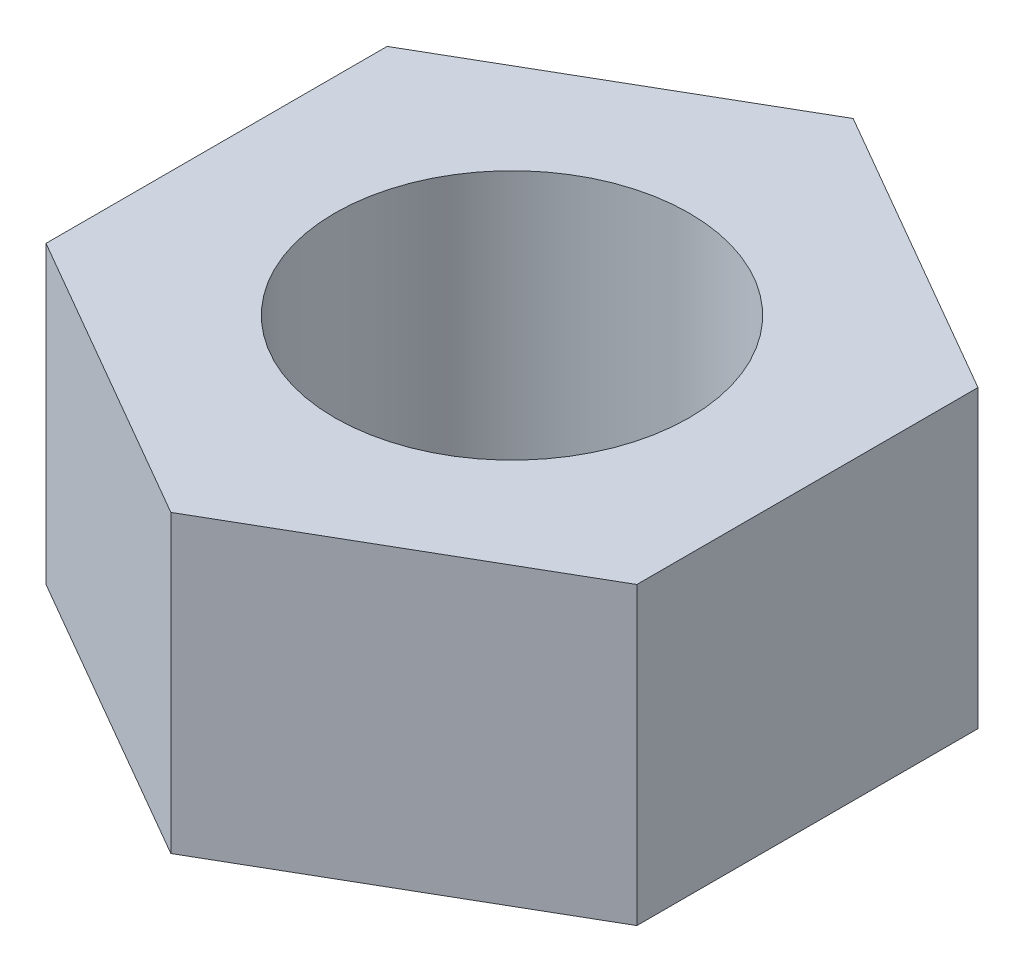
ISO-10303-21;
HEADER;
FILE_DESCRIPTION(('STEP AP214'),'2;1');
FILE_NAME('part.step','',(''),(''),'','','');
FILE_SCHEMA(('AUTOMOTIVE_DESIGN { 1 0 10303 214 1 1 1 1 }'));
ENDSEC;
DATA;
#1=APPLICATION_CONTEXT('core data for automotive mechanical design processes');
#2=APPLICATION_PROTOCOL_DEFINITION('international standard','automotive_design',2000,#1);
#3=PRODUCT_CONTEXT('',#1,'mechanical');
#4=PRODUCT('Part','Part','',(#3));
#5=PRODUCT_RELATED_PRODUCT_CATEGORY('part','',(#4));
#6=PRODUCT_DEFINITION_FORMATION('','',#4);
#7=PRODUCT_DEFINITION_CONTEXT('part definition',#1,'design');
#8=PRODUCT_DEFINITION('design','',#6,#7);
#9=PRODUCT_DEFINITION_SHAPE('','',#8);
#10=(LENGTH_UNIT() NAMED_UNIT(*) SI_UNIT(.MILLI.,.METRE.));
#11=(NAMED_UNIT(*) PLANE_ANGLE_UNIT() SI_UNIT($,.RADIAN.));
#12=(NAMED_UNIT(*) SI_UNIT($,.STERADIAN.) SOLID_ANGLE_UNIT());
#13=UNCERTAINTY_MEASURE_WITH_UNIT(LENGTH_MEASURE(1.E-05),#10,'distance_accuracy_value','');
#14=(GEOMETRIC_REPRESENTATION_CONTEXT(3) GLOBAL_UNCERTAINTY_ASSIGNED_CONTEXT((#13)) GLOBAL_UNIT_ASSIGNED_CONTEXT((#10,
#11,#12)) REPRESENTATION_CONTEXT('',''));
#15=CARTESIAN_POINT('',(0.,0.,0.));
#16=DIRECTION('',(0.,0.,1.));
#17=DIRECTION('',(1.,0.,0.));
#18=AXIS2_PLACEMENT_3D('',#15,#16,#17);
#19=CARTESIAN_POINT('',(0.,2.5,0.));
#20=DIRECTION('',(0.,1.,0.));
#21=DIRECTION('',(0.,0.,1.));
#22=AXIS2_PLACEMENT_3D('',#19,#20,#21);
#23=PLANE('',#22);
#24=DIRECTION('',(-0.866025403784439,0.,-0.5));
#25=VECTOR('',#24,1.);
#26=CARTESIAN_POINT('',(2.5,2.5,-1.44337567297406));
#27=LINE('',#26,#25);
#28=CARTESIAN_POINT('',(2.5,2.5,-1.44337567297406));
#29=VERTEX_POINT('',#28);
#30=CARTESIAN_POINT('',(0.,2.5,-2.88675134594813));
#31=VERTEX_POINT('',#30);
#32=EDGE_CURVE('E129',#29,#31,#27,.T.);
#33=ORIENTED_EDGE('',*,*,#32,.T.);
#34=DIRECTION('',(-0.866025403784439,0.,0.5));
#35=VECTOR('',#34,1.);
#36=CARTESIAN_POINT('',(0.,2.5,-2.88675134594813));
#37=LINE('',#36,#35);
#38=CARTESIAN_POINT('',(-2.5,2.5,-1.44337567297406));
#39=VERTEX_POINT('',#38);
#40=EDGE_CURVE('E87',#31,#39,#37,.T.);
#41=ORIENTED_EDGE('',*,*,#40,.T.);
#42=DIRECTION('',(0.,0.,1.));
#43=VECTOR('',#42,1.);
#44=CARTESIAN_POINT('',(-2.5,2.5,-1.44337567297406));
#45=LINE('',#44,#43);
#46=CARTESIAN_POINT('',(-2.5,2.5,1.44337567297406));
#47=VERTEX_POINT('',#46);
#48=EDGE_CURVE('E100',#39,#47,#45,.T.);
#49=ORIENTED_EDGE('',*,*,#48,.T.);
#50=DIRECTION('',(0.866025403784439,0.,0.5));
#51=VECTOR('',#50,1.);
#52=CARTESIAN_POINT('',(-2.5,2.5,1.44337567297406));
#53=LINE('',#52,#51);
#54=CARTESIAN_POINT('',(0.,2.5,2.88675134594813));
#55=VERTEX_POINT('',#54);
#56=EDGE_CURVE('E94',#47,#55,#53,.T.);
#57=ORIENTED_EDGE('',*,*,#56,.T.);
#58=DIRECTION('',(0.866025403784439,0.,-0.5));
#59=VECTOR('',#58,1.);
#60=CARTESIAN_POINT('',(0.,2.5,2.88675134594813));
#61=LINE('',#60,#59);
#62=CARTESIAN_POINT('',(2.5,2.5,1.44337567297407));
#63=VERTEX_POINT('',#62);
#64=EDGE_CURVE('E98',#55,#63,#61,.T.);
#65=ORIENTED_EDGE('',*,*,#64,.T.);
#66=DIRECTION('',(0.,0.,-1.));
#67=VECTOR('',#66,1.);
#68=CARTESIAN_POINT('',(2.5,2.5,1.44337567297407));
#69=LINE('',#68,#67);
#70=EDGE_CURVE('E50',#63,#29,#69,.T.);
#71=ORIENTED_EDGE('',*,*,#70,.T.);
#72=EDGE_LOOP('',(#33,#41,#49,#57,#65,#71));
#73=FACE_BOUND('',#72,.T.);
#74=CARTESIAN_POINT('',(0.,2.5,0.));
#75=DIRECTION('',(0.,1.,0.));
#76=DIRECTION('',(0.,0.,1.));
#77=AXIS2_PLACEMENT_3D('',#74,#75,#76);
#78=CIRCLE('',#77,1.5);
#79=CARTESIAN_POINT('',(0.,2.5,1.5));
#80=VERTEX_POINT('',#79);
#81=EDGE_CURVE('E122',#80,#80,#78,.T.);
#82=ORIENTED_EDGE('',*,*,#81,.F.);
#83=EDGE_LOOP('',(#82));
#84=FACE_BOUND('',#83,.T.);
#85=ADVANCED_FACE('F33',(#73,#84),#23,.T.);
#86=CARTESIAN_POINT('',(0.,0.,0.));
#87=DIRECTION('',(0.,1.,0.));
#88=DIRECTION('',(0.,0.,1.));
#89=AXIS2_PLACEMENT_3D('',#86,#87,#88);
#90=PLANE('',#89);
#91=DIRECTION('',(-0.866025403784439,0.,-0.5));
#92=VECTOR('',#91,1.);
#93=CARTESIAN_POINT('',(2.5,0.,-1.44337567297406));
#94=LINE('',#93,#92);
#95=CARTESIAN_POINT('',(2.5,0.,-1.44337567297406));
#96=VERTEX_POINT('',#95);
#97=CARTESIAN_POINT('',(0.,0.,-2.88675134594813));
#98=VERTEX_POINT('',#97);
#99=EDGE_CURVE('E118',#96,#98,#94,.T.);
#100=ORIENTED_EDGE('',*,*,#99,.F.);
#101=DIRECTION('',(0.,0.,-1.));
#102=VECTOR('',#101,1.);
#103=CARTESIAN_POINT('',(2.5,0.,1.44337567297407));
#104=LINE('',#103,#102);
#105=CARTESIAN_POINT('',(2.5,0.,1.44337567297407));
#106=VERTEX_POINT('',#105);
#107=EDGE_CURVE('E79',#106,#96,#104,.T.);
#108=ORIENTED_EDGE('',*,*,#107,.F.);
#109=DIRECTION('',(0.866025403784439,0.,-0.5));
#110=VECTOR('',#109,1.);
#111=CARTESIAN_POINT('',(0.,0.,2.88675134594813));
#112=LINE('',#111,#110);
#113=CARTESIAN_POINT('',(0.,0.,2.88675134594813));
#114=VERTEX_POINT('',#113);
#115=EDGE_CURVE('E73',#114,#106,#112,.T.);
#116=ORIENTED_EDGE('',*,*,#115,.F.);
#117=DIRECTION('',(0.866025403784439,0.,0.5));
#118=VECTOR('',#117,1.);
#119=CARTESIAN_POINT('',(-2.5,0.,1.44337567297406));
#120=LINE('',#119,#118);
#121=CARTESIAN_POINT('',(-2.5,0.,1.44337567297406));
#122=VERTEX_POINT('',#121);
#123=EDGE_CURVE('E108',#122,#114,#120,.T.);
#124=ORIENTED_EDGE('',*,*,#123,.F.);
#125=DIRECTION('',(0.,0.,1.));
#126=VECTOR('',#125,1.);
#127=CARTESIAN_POINT('',(-2.5,0.,-1.44337567297406));
#128=LINE('',#127,#126);
#129=CARTESIAN_POINT('',(-2.5,0.,-1.44337567297406));
#130=VERTEX_POINT('',#129);
#131=EDGE_CURVE('E124',#130,#122,#128,.T.);
#132=ORIENTED_EDGE('',*,*,#131,.F.);
#133=DIRECTION('',(-0.866025403784439,0.,0.5));
#134=VECTOR('',#133,1.);
#135=CARTESIAN_POINT('',(0.,0.,-2.88675134594813));
#136=LINE('',#135,#134);
#137=EDGE_CURVE('E121',#98,#130,#136,.T.);
#138=ORIENTED_EDGE('',*,*,#137,.F.);
#139=EDGE_LOOP('',(#100,#108,#116,#124,#132,#138));
#140=FACE_BOUND('',#139,.T.);
#141=CARTESIAN_POINT('',(0.,0.,0.));
#142=DIRECTION('',(0.,1.,0.));
#143=DIRECTION('',(0.,0.,1.));
#144=AXIS2_PLACEMENT_3D('',#141,#142,#143);
#145=CIRCLE('',#144,1.5);
#146=CARTESIAN_POINT('',(0.,0.,1.5));
#147=VERTEX_POINT('',#146);
#148=EDGE_CURVE('E222',#147,#147,#145,.T.);
#149=ORIENTED_EDGE('',*,*,#148,.T.);
#150=EDGE_LOOP('',(#149));
#151=FACE_BOUND('',#150,.T.);
#152=ADVANCED_FACE('F138',(#140,#151),#90,.F.);
#153=CARTESIAN_POINT('',(2.5,2.5,-1.44337567297406));
#154=DIRECTION('',(-0.5,0.,0.866025403784439));
#155=DIRECTION('',(0.866025403784439,0.,0.5));
#156=AXIS2_PLACEMENT_3D('',#153,#154,#155);
#157=PLANE('',#156);
#158=ORIENTED_EDGE('',*,*,#99,.T.);
#159=DIRECTION('',(0.,-1.,0.));
#160=VECTOR('',#159,1.);
#161=CARTESIAN_POINT('',(0.,2.5,-2.88675134594813));
#162=LINE('',#161,#160);
#163=EDGE_CURVE('E11',#31,#98,#162,.T.);
#164=ORIENTED_EDGE('',*,*,#163,.F.);
#165=ORIENTED_EDGE('',*,*,#32,.F.);
#166=DIRECTION('',(0.,-1.,0.));
#167=VECTOR('',#166,1.);
#168=CARTESIAN_POINT('',(2.5,2.5,-1.44337567297406));
#169=LINE('',#168,#167);
#170=EDGE_CURVE('E114',#29,#96,#169,.T.);
#171=ORIENTED_EDGE('',*,*,#170,.T.);
#172=EDGE_LOOP('',(#158,#164,#165,#171));
#173=FACE_BOUND('',#172,.T.);
#174=ADVANCED_FACE('F35',(#173),#157,.F.);
#175=CARTESIAN_POINT('',(0.,2.5,-2.88675134594813));
#176=DIRECTION('',(0.5,0.,0.866025403784439));
#177=DIRECTION('',(0.866025403784439,0.,-0.5));
#178=AXIS2_PLACEMENT_3D('',#175,#176,#177);
#179=PLANE('',#178);
#180=ORIENTED_EDGE('',*,*,#137,.T.);
#181=DIRECTION('',(0.,-1.,0.));
#182=VECTOR('',#181,1.);
#183=CARTESIAN_POINT('',(-2.5,2.5,-1.44337567297406));
#184=LINE('',#183,#182);
#185=EDGE_CURVE('E42',#39,#130,#184,.T.);
#186=ORIENTED_EDGE('',*,*,#185,.F.);
#187=ORIENTED_EDGE('',*,*,#40,.F.);
#188=ORIENTED_EDGE('',*,*,#163,.T.);
#189=EDGE_LOOP('',(#180,#186,#187,#188));
#190=FACE_BOUND('',#189,.T.);
#191=ADVANCED_FACE('F163',(#190),#179,.F.);
#192=CARTESIAN_POINT('',(-2.5,2.5,-1.44337567297406));
#193=DIRECTION('',(1.,0.,0.));
#194=DIRECTION('',(0.,0.,-1.));
#195=AXIS2_PLACEMENT_3D('',#192,#193,#194);
#196=PLANE('',#195);
#197=ORIENTED_EDGE('',*,*,#131,.T.);
#198=DIRECTION('',(0.,-1.,0.));
#199=VECTOR('',#198,1.);
#200=CARTESIAN_POINT('',(-2.5,2.5,1.44337567297406));
#201=LINE('',#200,#199);
#202=EDGE_CURVE('E109',#47,#122,#201,.T.);
#203=ORIENTED_EDGE('',*,*,#202,.F.);
#204=ORIENTED_EDGE('',*,*,#48,.F.);
#205=ORIENTED_EDGE('',*,*,#185,.T.);
#206=EDGE_LOOP('',(#197,#203,#204,#205));
#207=FACE_BOUND('',#206,.T.);
#208=ADVANCED_FACE('F135',(#207),#196,.F.);
#209=CARTESIAN_POINT('',(-2.5,2.5,1.44337567297406));
#210=DIRECTION('',(0.5,0.,-0.866025403784439));
#211=DIRECTION('',(-0.866025403784439,0.,-0.5));
#212=AXIS2_PLACEMENT_3D('',#209,#210,#211);
#213=PLANE('',#212);
#214=ORIENTED_EDGE('',*,*,#123,.T.);
#215=DIRECTION('',(0.,-1.,0.));
#216=VECTOR('',#215,1.);
#217=CARTESIAN_POINT('',(0.,2.5,2.88675134594813));
#218=LINE('',#217,#216);
#219=EDGE_CURVE('E105',#55,#114,#218,.T.);
#220=ORIENTED_EDGE('',*,*,#219,.F.);
#221=ORIENTED_EDGE('',*,*,#56,.F.);
#222=ORIENTED_EDGE('',*,*,#202,.T.);
#223=EDGE_LOOP('',(#214,#220,#221,#222));
#224=FACE_BOUND('',#223,.T.);
#225=ADVANCED_FACE('F106',(#224),#213,.F.);
#226=CARTESIAN_POINT('',(0.,2.5,2.88675134594813));
#227=DIRECTION('',(-0.5,0.,-0.866025403784439));
#228=DIRECTION('',(-0.866025403784439,0.,0.5));
#229=AXIS2_PLACEMENT_3D('',#226,#227,#228);
#230=PLANE('',#229);
#231=ORIENTED_EDGE('',*,*,#115,.T.);
#232=DIRECTION('',(0.,-1.,0.));
#233=VECTOR('',#232,1.);
#234=CARTESIAN_POINT('',(2.5,2.5,1.44337567297407));
#235=LINE('',#234,#233);
#236=EDGE_CURVE('E110',#63,#106,#235,.T.);
#237=ORIENTED_EDGE('',*,*,#236,.F.);
#238=ORIENTED_EDGE('',*,*,#64,.F.);
#239=ORIENTED_EDGE('',*,*,#219,.T.);
#240=EDGE_LOOP('',(#231,#237,#238,#239));
#241=FACE_BOUND('',#240,.T.);
#242=ADVANCED_FACE('F112',(#241),#230,.F.);
#243=CARTESIAN_POINT('',(2.5,2.5,1.44337567297407));
#244=DIRECTION('',(-1.,0.,0.));
#245=DIRECTION('',(0.,0.,1.));
#246=AXIS2_PLACEMENT_3D('',#243,#244,#245);
#247=PLANE('',#246);
#248=ORIENTED_EDGE('',*,*,#107,.T.);
#249=ORIENTED_EDGE('',*,*,#170,.F.);
#250=ORIENTED_EDGE('',*,*,#70,.F.);
#251=ORIENTED_EDGE('',*,*,#236,.T.);
#252=EDGE_LOOP('',(#248,#249,#250,#251));
#253=FACE_BOUND('',#252,.T.);
#254=ADVANCED_FACE('F143',(#253),#247,.F.);
#255=CARTESIAN_POINT('',(0.,2.5,0.));
#256=DIRECTION('',(0.,-1.,0.));
#257=DIRECTION('',(0.,0.,-1.));
#258=AXIS2_PLACEMENT_3D('',#255,#256,#257);
#259=CYLINDRICAL_SURFACE('',#258,1.5);
#260=ORIENTED_EDGE('',*,*,#81,.T.);
#261=EDGE_LOOP('',(#260));
#262=FACE_BOUND('',#261,.T.);
#263=ORIENTED_EDGE('',*,*,#148,.F.);
#264=EDGE_LOOP('',(#263));
#265=FACE_BOUND('',#264,.T.);
#266=ADVANCED_FACE('F145',(#262,#265),#259,.F.);
#267=CLOSED_SHELL('',(#85,#152,#174,#191,#208,#225,#242,#254,#266));
#268=MANIFOLD_SOLID_BREP('B2',#267);
#269=ADVANCED_BREP_SHAPE_REPRESENTATION('',(#18,#268),#14);
#270=SHAPE_DEFINITION_REPRESENTATION(#9,#269);
ENDSEC;
END-ISO-10303-21;
